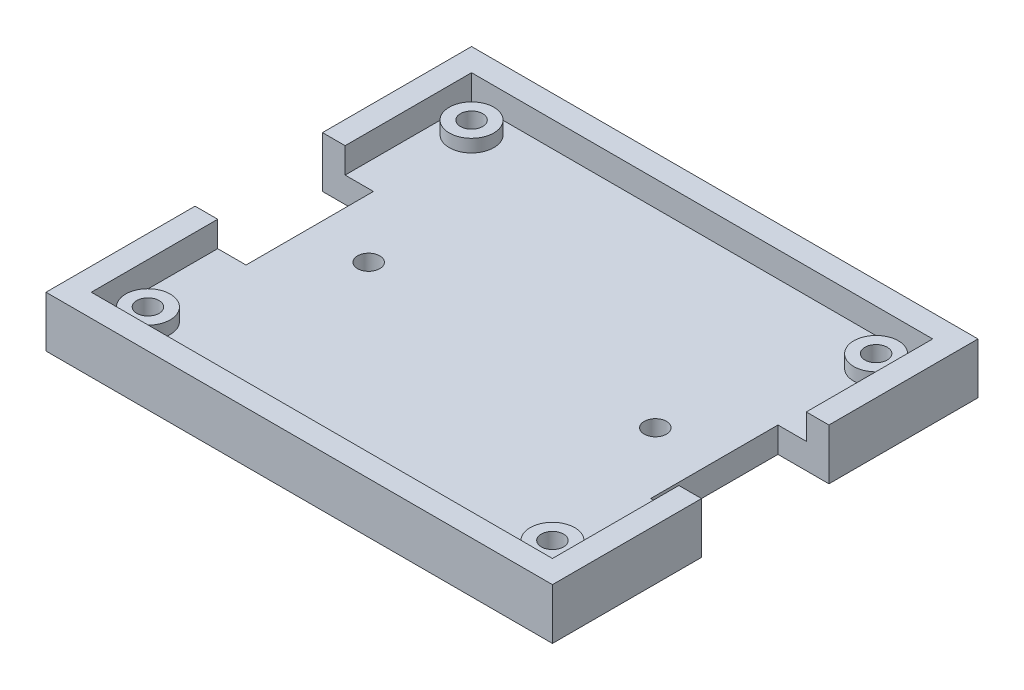
ISO-10303-21;
HEADER;
FILE_DESCRIPTION(('STEP AP214'),'2;1');
FILE_NAME('part.step','',(''),(''),'','','');
FILE_SCHEMA(('AUTOMOTIVE_DESIGN { 1 0 10303 214 1 1 1 1 }'));
ENDSEC;
DATA;
#1=APPLICATION_CONTEXT('core data for automotive mechanical design processes');
#2=APPLICATION_PROTOCOL_DEFINITION('international standard','automotive_design',2000,#1);
#3=PRODUCT_CONTEXT('',#1,'mechanical');
#4=PRODUCT('Part','Part','',(#3));
#5=PRODUCT_RELATED_PRODUCT_CATEGORY('part','',(#4));
#6=PRODUCT_DEFINITION_FORMATION('','',#4);
#7=PRODUCT_DEFINITION_CONTEXT('part definition',#1,'design');
#8=PRODUCT_DEFINITION('design','',#6,#7);
#9=PRODUCT_DEFINITION_SHAPE('','',#8);
#10=(LENGTH_UNIT() NAMED_UNIT(*) SI_UNIT(.MILLI.,.METRE.));
#11=(NAMED_UNIT(*) PLANE_ANGLE_UNIT() SI_UNIT($,.RADIAN.));
#12=(NAMED_UNIT(*) SI_UNIT($,.STERADIAN.) SOLID_ANGLE_UNIT());
#13=UNCERTAINTY_MEASURE_WITH_UNIT(LENGTH_MEASURE(1.E-05),#10,'distance_accuracy_value','');
#14=(GEOMETRIC_REPRESENTATION_CONTEXT(3) GLOBAL_UNCERTAINTY_ASSIGNED_CONTEXT((#13)) GLOBAL_UNIT_ASSIGNED_CONTEXT((#10,
#11,#12)) REPRESENTATION_CONTEXT('',''));
#15=CARTESIAN_POINT('',(0.,0.,0.));
#16=DIRECTION('',(0.,0.,1.));
#17=DIRECTION('',(1.,0.,0.));
#18=AXIS2_PLACEMENT_3D('',#15,#16,#17);
#19=CARTESIAN_POINT('',(0.,4.,10.));
#20=DIRECTION('',(0.,0.,-1.));
#21=DIRECTION('',(-1.,0.,0.));
#22=AXIS2_PLACEMENT_3D('',#19,#20,#21);
#23=PLANE('',#22);
#24=DIRECTION('',(1.,0.,0.));
#25=VECTOR('',#24,1.);
#26=CARTESIAN_POINT('',(0.,0.,10.));
#27=LINE('',#26,#25);
#28=CARTESIAN_POINT('',(31.75,0.,10.));
#29=VERTEX_POINT('',#28);
#30=CARTESIAN_POINT('',(39.75,0.,10.));
#31=VERTEX_POINT('',#30);
#32=EDGE_CURVE('E334',#29,#31,#27,.T.);
#33=ORIENTED_EDGE('',*,*,#32,.F.);
#34=DIRECTION('',(0.,-1.,0.));
#35=VECTOR('',#34,1.);
#36=CARTESIAN_POINT('',(31.75,4.,10.));
#37=LINE('',#36,#35);
#38=CARTESIAN_POINT('',(31.75,4.,10.));
#39=VERTEX_POINT('',#38);
#40=EDGE_CURVE('E11',#39,#29,#37,.T.);
#41=ORIENTED_EDGE('',*,*,#40,.F.);
#42=DIRECTION('',(1.,0.,0.));
#43=VECTOR('',#42,1.);
#44=CARTESIAN_POINT('',(0.,4.,10.));
#45=LINE('',#44,#43);
#46=CARTESIAN_POINT('',(36.195,4.,10.));
#47=VERTEX_POINT('',#46);
#48=EDGE_CURVE('E348',#39,#47,#45,.T.);
#49=ORIENTED_EDGE('',*,*,#48,.T.);
#50=DIRECTION('',(0.,-1.,0.));
#51=VECTOR('',#50,1.);
#52=CARTESIAN_POINT('',(36.195,8.,10.));
#53=LINE('',#52,#51);
#54=CARTESIAN_POINT('',(36.195,8.,10.));
#55=VERTEX_POINT('',#54);
#56=EDGE_CURVE('E304',#55,#47,#53,.T.);
#57=ORIENTED_EDGE('',*,*,#56,.F.);
#58=DIRECTION('',(1.,0.,0.));
#59=VECTOR('',#58,1.);
#60=CARTESIAN_POINT('',(0.,8.,10.));
#61=LINE('',#60,#59);
#62=CARTESIAN_POINT('',(39.75,8.,10.));
#63=VERTEX_POINT('',#62);
#64=EDGE_CURVE('E285',#55,#63,#61,.T.);
#65=ORIENTED_EDGE('',*,*,#64,.T.);
#66=DIRECTION('',(0.,-1.,0.));
#67=VECTOR('',#66,1.);
#68=CARTESIAN_POINT('',(39.75,8.,10.));
#69=LINE('',#68,#67);
#70=EDGE_CURVE('E307',#63,#31,#69,.T.);
#71=ORIENTED_EDGE('',*,*,#70,.T.);
#72=EDGE_LOOP('',(#33,#41,#49,#57,#65,#71));
#73=FACE_BOUND('',#72,.T.);
#74=ADVANCED_FACE('F41',(#73),#23,.T.);
#75=CARTESIAN_POINT('',(31.75,4.,0.));
#76=DIRECTION('',(-1.,0.,0.));
#77=DIRECTION('',(0.,0.,1.));
#78=AXIS2_PLACEMENT_3D('',#75,#76,#77);
#79=PLANE('',#78);
#80=DIRECTION('',(0.,0.,-1.));
#81=VECTOR('',#80,1.);
#82=CARTESIAN_POINT('',(31.75,0.,0.));
#83=LINE('',#82,#81);
#84=CARTESIAN_POINT('',(31.75,0.,-9.99999999999999));
#85=VERTEX_POINT('',#84);
#86=EDGE_CURVE('E396',#29,#85,#83,.T.);
#87=ORIENTED_EDGE('',*,*,#86,.T.);
#88=DIRECTION('',(0.,-1.,0.));
#89=VECTOR('',#88,1.);
#90=CARTESIAN_POINT('',(31.75,4.,-9.99999999999999));
#91=LINE('',#90,#89);
#92=CARTESIAN_POINT('',(31.75,4.,-9.99999999999999));
#93=VERTEX_POINT('',#92);
#94=EDGE_CURVE('E51',#93,#85,#91,.T.);
#95=ORIENTED_EDGE('',*,*,#94,.F.);
#96=DIRECTION('',(0.,0.,-1.));
#97=VECTOR('',#96,1.);
#98=CARTESIAN_POINT('',(31.75,4.,0.));
#99=LINE('',#98,#97);
#100=EDGE_CURVE('E351',#39,#93,#99,.T.);
#101=ORIENTED_EDGE('',*,*,#100,.F.);
#102=ORIENTED_EDGE('',*,*,#40,.T.);
#103=EDGE_LOOP('',(#87,#95,#101,#102));
#104=FACE_BOUND('',#103,.T.);
#105=ADVANCED_FACE('F43',(#104),#79,.F.);
#106=CARTESIAN_POINT('',(0.,4.,-9.99999999999999));
#107=DIRECTION('',(0.,0.,-1.));
#108=DIRECTION('',(-1.,0.,0.));
#109=AXIS2_PLACEMENT_3D('',#106,#107,#108);
#110=PLANE('',#109);
#111=DIRECTION('',(1.,0.,0.));
#112=VECTOR('',#111,1.);
#113=CARTESIAN_POINT('',(0.,0.,-9.99999999999999));
#114=LINE('',#113,#112);
#115=CARTESIAN_POINT('',(39.75,0.,-9.99999999999999));
#116=VERTEX_POINT('',#115);
#117=EDGE_CURVE('E401',#85,#116,#114,.T.);
#118=ORIENTED_EDGE('',*,*,#117,.T.);
#119=DIRECTION('',(0.,-1.,0.));
#120=VECTOR('',#119,1.);
#121=CARTESIAN_POINT('',(39.75,8.,-9.99999999999999));
#122=LINE('',#121,#120);
#123=CARTESIAN_POINT('',(39.75,8.,-9.99999999999999));
#124=VERTEX_POINT('',#123);
#125=EDGE_CURVE('E196',#124,#116,#122,.T.);
#126=ORIENTED_EDGE('',*,*,#125,.F.);
#127=DIRECTION('',(1.,0.,0.));
#128=VECTOR('',#127,1.);
#129=CARTESIAN_POINT('',(0.,8.,-9.99999999999999));
#130=LINE('',#129,#128);
#131=CARTESIAN_POINT('',(36.195,8.,-9.99999999999999));
#132=VERTEX_POINT('',#131);
#133=EDGE_CURVE('E199',#132,#124,#130,.T.);
#134=ORIENTED_EDGE('',*,*,#133,.F.);
#135=DIRECTION('',(0.,-1.,0.));
#136=VECTOR('',#135,1.);
#137=CARTESIAN_POINT('',(36.195,8.,-9.99999999999999));
#138=LINE('',#137,#136);
#139=CARTESIAN_POINT('',(36.195,4.,-9.99999999999999));
#140=VERTEX_POINT('',#139);
#141=EDGE_CURVE('E184',#132,#140,#138,.T.);
#142=ORIENTED_EDGE('',*,*,#141,.T.);
#143=DIRECTION('',(1.,0.,0.));
#144=VECTOR('',#143,1.);
#145=CARTESIAN_POINT('',(0.,4.,-9.99999999999999));
#146=LINE('',#145,#144);
#147=EDGE_CURVE('E356',#93,#140,#146,.T.);
#148=ORIENTED_EDGE('',*,*,#147,.F.);
#149=ORIENTED_EDGE('',*,*,#94,.T.);
#150=EDGE_LOOP('',(#118,#126,#134,#142,#148,#149));
#151=FACE_BOUND('',#150,.T.);
#152=ADVANCED_FACE('F200',(#151),#110,.F.);
#153=CARTESIAN_POINT('',(-39.75,0.,-9.99999999999999));
#154=VERTEX_POINT('',#153);
#155=CARTESIAN_POINT('',(-31.75,0.,-9.99999999999999));
#156=VERTEX_POINT('',#155);
#157=EDGE_CURVE('E404',#154,#156,#114,.T.);
#158=ORIENTED_EDGE('',*,*,#157,.T.);
#159=DIRECTION('',(0.,-1.,0.));
#160=VECTOR('',#159,1.);
#161=CARTESIAN_POINT('',(-31.75,4.,-9.99999999999999));
#162=LINE('',#161,#160);
#163=CARTESIAN_POINT('',(-31.75,4.,-9.99999999999999));
#164=VERTEX_POINT('',#163);
#165=EDGE_CURVE('E74',#164,#156,#162,.T.);
#166=ORIENTED_EDGE('',*,*,#165,.F.);
#167=CARTESIAN_POINT('',(-36.195,4.,-9.99999999999999));
#168=VERTEX_POINT('',#167);
#169=EDGE_CURVE('E359',#168,#164,#146,.T.);
#170=ORIENTED_EDGE('',*,*,#169,.F.);
#171=DIRECTION('',(0.,-1.,0.));
#172=VECTOR('',#171,1.);
#173=CARTESIAN_POINT('',(-36.195,8.,-9.99999999999999));
#174=LINE('',#173,#172);
#175=CARTESIAN_POINT('',(-36.195,8.,-9.99999999999999));
#176=VERTEX_POINT('',#175);
#177=EDGE_CURVE('E253',#176,#168,#174,.T.);
#178=ORIENTED_EDGE('',*,*,#177,.F.);
#179=CARTESIAN_POINT('',(-39.75,8.,-9.99999999999999));
#180=VERTEX_POINT('',#179);
#181=EDGE_CURVE('E207',#180,#176,#130,.T.);
#182=ORIENTED_EDGE('',*,*,#181,.F.);
#183=DIRECTION('',(0.,-1.,0.));
#184=VECTOR('',#183,1.);
#185=CARTESIAN_POINT('',(-39.75,8.,-9.99999999999999));
#186=LINE('',#185,#184);
#187=EDGE_CURVE('E256',#180,#154,#186,.T.);
#188=ORIENTED_EDGE('',*,*,#187,.T.);
#189=EDGE_LOOP('',(#158,#166,#170,#178,#182,#188));
#190=FACE_BOUND('',#189,.T.);
#191=ADVANCED_FACE('F474',(#190),#110,.F.);
#192=CARTESIAN_POINT('',(-31.75,4.,0.));
#193=DIRECTION('',(-1.,0.,0.));
#194=DIRECTION('',(0.,0.,1.));
#195=AXIS2_PLACEMENT_3D('',#192,#193,#194);
#196=PLANE('',#195);
#197=DIRECTION('',(0.,0.,-1.));
#198=VECTOR('',#197,1.);
#199=CARTESIAN_POINT('',(-31.75,0.,0.));
#200=LINE('',#199,#198);
#201=CARTESIAN_POINT('',(-31.75,0.,10.));
#202=VERTEX_POINT('',#201);
#203=EDGE_CURVE('E405',#202,#156,#200,.T.);
#204=ORIENTED_EDGE('',*,*,#203,.F.);
#205=DIRECTION('',(0.,-1.,0.));
#206=VECTOR('',#205,1.);
#207=CARTESIAN_POINT('',(-31.75,4.,10.));
#208=LINE('',#207,#206);
#209=CARTESIAN_POINT('',(-31.75,4.,10.));
#210=VERTEX_POINT('',#209);
#211=EDGE_CURVE('E59',#210,#202,#208,.T.);
#212=ORIENTED_EDGE('',*,*,#211,.F.);
#213=DIRECTION('',(0.,0.,-1.));
#214=VECTOR('',#213,1.);
#215=CARTESIAN_POINT('',(-31.75,4.,0.));
#216=LINE('',#215,#214);
#217=EDGE_CURVE('E368',#210,#164,#216,.T.);
#218=ORIENTED_EDGE('',*,*,#217,.T.);
#219=ORIENTED_EDGE('',*,*,#165,.T.);
#220=EDGE_LOOP('',(#204,#212,#218,#219));
#221=FACE_BOUND('',#220,.T.);
#222=ADVANCED_FACE('F501',(#221),#196,.T.);
#223=CARTESIAN_POINT('',(-39.75,0.,10.));
#224=VERTEX_POINT('',#223);
#225=EDGE_CURVE('E397',#224,#202,#27,.T.);
#226=ORIENTED_EDGE('',*,*,#225,.F.);
#227=DIRECTION('',(0.,-1.,0.));
#228=VECTOR('',#227,1.);
#229=CARTESIAN_POINT('',(-39.75,8.,10.));
#230=LINE('',#229,#228);
#231=CARTESIAN_POINT('',(-39.75,8.,10.));
#232=VERTEX_POINT('',#231);
#233=EDGE_CURVE('E318',#232,#224,#230,.T.);
#234=ORIENTED_EDGE('',*,*,#233,.F.);
#235=CARTESIAN_POINT('',(-36.195,8.,10.));
#236=VERTEX_POINT('',#235);
#237=EDGE_CURVE('E280',#232,#236,#61,.T.);
#238=ORIENTED_EDGE('',*,*,#237,.T.);
#239=DIRECTION('',(0.,-1.,0.));
#240=VECTOR('',#239,1.);
#241=CARTESIAN_POINT('',(-36.195,8.,10.));
#242=LINE('',#241,#240);
#243=CARTESIAN_POINT('',(-36.195,4.,10.));
#244=VERTEX_POINT('',#243);
#245=EDGE_CURVE('E322',#236,#244,#242,.T.);
#246=ORIENTED_EDGE('',*,*,#245,.T.);
#247=EDGE_CURVE('E352',#244,#210,#45,.T.);
#248=ORIENTED_EDGE('',*,*,#247,.T.);
#249=ORIENTED_EDGE('',*,*,#211,.T.);
#250=EDGE_LOOP('',(#226,#234,#238,#246,#248,#249));
#251=FACE_BOUND('',#250,.T.);
#252=ADVANCED_FACE('F445',(#251),#23,.T.);
#253=CARTESIAN_POINT('',(22.5,4.,0.));
#254=DIRECTION('',(0.,-1.,0.));
#255=DIRECTION('',(0.,0.,-1.));
#256=AXIS2_PLACEMENT_3D('',#253,#254,#255);
#257=CYLINDRICAL_SURFACE('',#256,1.75);
#258=CARTESIAN_POINT('',(22.5,4.,0.));
#259=DIRECTION('',(0.,1.,0.));
#260=DIRECTION('',(0.,0.,1.));
#261=AXIS2_PLACEMENT_3D('',#258,#259,#260);
#262=CIRCLE('',#261,1.75);
#263=CARTESIAN_POINT('',(22.5,4.,1.75));
#264=VERTEX_POINT('',#263);
#265=EDGE_CURVE('E386',#264,#264,#262,.T.);
#266=ORIENTED_EDGE('',*,*,#265,.T.);
#267=EDGE_LOOP('',(#266));
#268=FACE_BOUND('',#267,.T.);
#269=CARTESIAN_POINT('',(22.5,0.,0.));
#270=DIRECTION('',(0.,1.,0.));
#271=DIRECTION('',(0.,0.,1.));
#272=AXIS2_PLACEMENT_3D('',#269,#270,#271);
#273=CIRCLE('',#272,1.75);
#274=CARTESIAN_POINT('',(22.5,0.,1.75));
#275=VERTEX_POINT('',#274);
#276=EDGE_CURVE('E409',#275,#275,#273,.T.);
#277=ORIENTED_EDGE('',*,*,#276,.F.);
#278=EDGE_LOOP('',(#277));
#279=FACE_BOUND('',#278,.T.);
#280=ADVANCED_FACE('F500',(#268,#279),#257,.F.);
#281=CARTESIAN_POINT('',(-22.5,4.,0.));
#282=DIRECTION('',(0.,-1.,0.));
#283=DIRECTION('',(0.,0.,-1.));
#284=AXIS2_PLACEMENT_3D('',#281,#282,#283);
#285=CYLINDRICAL_SURFACE('',#284,1.75);
#286=CARTESIAN_POINT('',(-22.5,4.,0.));
#287=DIRECTION('',(0.,1.,0.));
#288=DIRECTION('',(0.,0.,1.));
#289=AXIS2_PLACEMENT_3D('',#286,#287,#288);
#290=CIRCLE('',#289,1.75);
#291=CARTESIAN_POINT('',(-22.5,4.,1.75));
#292=VERTEX_POINT('',#291);
#293=EDGE_CURVE('E390',#292,#292,#290,.T.);
#294=ORIENTED_EDGE('',*,*,#293,.T.);
#295=EDGE_LOOP('',(#294));
#296=FACE_BOUND('',#295,.T.);
#297=CARTESIAN_POINT('',(-22.5,0.,0.));
#298=DIRECTION('',(0.,1.,0.));
#299=DIRECTION('',(0.,0.,1.));
#300=AXIS2_PLACEMENT_3D('',#297,#298,#299);
#301=CIRCLE('',#300,1.75);
#302=CARTESIAN_POINT('',(-22.5,0.,1.75));
#303=VERTEX_POINT('',#302);
#304=EDGE_CURVE('E340',#303,#303,#301,.T.);
#305=ORIENTED_EDGE('',*,*,#304,.F.);
#306=EDGE_LOOP('',(#305));
#307=FACE_BOUND('',#306,.T.);
#308=ADVANCED_FACE('F506',(#296,#307),#285,.F.);
#309=CARTESIAN_POINT('',(0.,4.,0.));
#310=DIRECTION('',(0.,1.,0.));
#311=DIRECTION('',(0.,0.,1.));
#312=AXIS2_PLACEMENT_3D('',#309,#310,#311);
#313=PLANE('',#312);
#314=CARTESIAN_POINT('',(31.75,4.,-25.4));
#315=DIRECTION('',(0.,1.,0.));
#316=DIRECTION('',(0.,0.,1.));
#317=AXIS2_PLACEMENT_3D('',#314,#315,#316);
#318=CIRCLE('',#317,3.5);
#319=CARTESIAN_POINT('',(31.75,4.,-21.9));
#320=VERTEX_POINT('',#319);
#321=EDGE_CURVE('E335',#320,#320,#318,.T.);
#322=ORIENTED_EDGE('',*,*,#321,.F.);
#323=EDGE_LOOP('',(#322));
#324=FACE_BOUND('',#323,.T.);
#325=CARTESIAN_POINT('',(-31.75,4.,-25.4));
#326=DIRECTION('',(0.,1.,0.));
#327=DIRECTION('',(0.,0.,1.));
#328=AXIS2_PLACEMENT_3D('',#325,#326,#327);
#329=CIRCLE('',#328,3.5);
#330=CARTESIAN_POINT('',(-31.75,4.,-21.9));
#331=VERTEX_POINT('',#330);
#332=EDGE_CURVE('E339',#331,#331,#329,.T.);
#333=ORIENTED_EDGE('',*,*,#332,.F.);
#334=EDGE_LOOP('',(#333));
#335=FACE_BOUND('',#334,.T.);
#336=CARTESIAN_POINT('',(31.75,4.,25.4));
#337=DIRECTION('',(0.,1.,0.));
#338=DIRECTION('',(0.,0.,1.));
#339=AXIS2_PLACEMENT_3D('',#336,#337,#338);
#340=CIRCLE('',#339,3.5);
#341=CARTESIAN_POINT('',(31.75,4.,28.9));
#342=VERTEX_POINT('',#341);
#343=EDGE_CURVE('E344',#342,#342,#340,.T.);
#344=ORIENTED_EDGE('',*,*,#343,.F.);
#345=EDGE_LOOP('',(#344));
#346=FACE_BOUND('',#345,.T.);
#347=ORIENTED_EDGE('',*,*,#48,.F.);
#348=ORIENTED_EDGE('',*,*,#100,.T.);
#349=ORIENTED_EDGE('',*,*,#147,.T.);
#350=DIRECTION('',(0.,0.,-1.));
#351=VECTOR('',#350,1.);
#352=CARTESIAN_POINT('',(36.195,4.,0.));
#353=LINE('',#352,#351);
#354=CARTESIAN_POINT('',(36.195,4.,-29.845));
#355=VERTEX_POINT('',#354);
#356=EDGE_CURVE('E191',#140,#355,#353,.T.);
#357=ORIENTED_EDGE('',*,*,#356,.T.);
#358=DIRECTION('',(1.,0.,0.));
#359=VECTOR('',#358,1.);
#360=CARTESIAN_POINT('',(0.,4.,-29.845));
#361=LINE('',#360,#359);
#362=CARTESIAN_POINT('',(-36.195,4.,-29.845));
#363=VERTEX_POINT('',#362);
#364=EDGE_CURVE('E362',#363,#355,#361,.T.);
#365=ORIENTED_EDGE('',*,*,#364,.F.);
#366=DIRECTION('',(0.,0.,-1.));
#367=VECTOR('',#366,1.);
#368=CARTESIAN_POINT('',(-36.195,4.,0.));
#369=LINE('',#368,#367);
#370=EDGE_CURVE('E365',#168,#363,#369,.T.);
#371=ORIENTED_EDGE('',*,*,#370,.F.);
#372=ORIENTED_EDGE('',*,*,#169,.T.);
#373=ORIENTED_EDGE('',*,*,#217,.F.);
#374=ORIENTED_EDGE('',*,*,#247,.F.);
#375=DIRECTION('',(0.,0.,-1.));
#376=VECTOR('',#375,1.);
#377=CARTESIAN_POINT('',(-36.195,4.,0.));
#378=LINE('',#377,#376);
#379=CARTESIAN_POINT('',(-36.195,4.,29.845));
#380=VERTEX_POINT('',#379);
#381=EDGE_CURVE('E371',#380,#244,#378,.T.);
#382=ORIENTED_EDGE('',*,*,#381,.F.);
#383=DIRECTION('',(1.,0.,0.));
#384=VECTOR('',#383,1.);
#385=CARTESIAN_POINT('',(0.,4.,29.845));
#386=LINE('',#385,#384);
#387=CARTESIAN_POINT('',(36.195,4.,29.845));
#388=VERTEX_POINT('',#387);
#389=EDGE_CURVE('E374',#380,#388,#386,.T.);
#390=ORIENTED_EDGE('',*,*,#389,.T.);
#391=DIRECTION('',(0.,0.,-1.));
#392=VECTOR('',#391,1.);
#393=CARTESIAN_POINT('',(36.195,4.,0.));
#394=LINE('',#393,#392);
#395=EDGE_CURVE('E378',#388,#47,#394,.T.);
#396=ORIENTED_EDGE('',*,*,#395,.T.);
#397=EDGE_LOOP('',(#347,#348,#349,#357,#365,#371,#372,#373,#374,#382,#390,#396));
#398=FACE_BOUND('',#397,.T.);
#399=CARTESIAN_POINT('',(-31.75,4.,25.4));
#400=DIRECTION('',(0.,1.,0.));
#401=DIRECTION('',(0.,0.,1.));
#402=AXIS2_PLACEMENT_3D('',#399,#400,#401);
#403=CIRCLE('',#402,3.5);
#404=CARTESIAN_POINT('',(-31.75,4.,28.9));
#405=VERTEX_POINT('',#404);
#406=EDGE_CURVE('E382',#405,#405,#403,.T.);
#407=ORIENTED_EDGE('',*,*,#406,.F.);
#408=EDGE_LOOP('',(#407));
#409=FACE_BOUND('',#408,.T.);
#410=ORIENTED_EDGE('',*,*,#265,.F.);
#411=EDGE_LOOP('',(#410));
#412=FACE_BOUND('',#411,.T.);
#413=ORIENTED_EDGE('',*,*,#293,.F.);
#414=EDGE_LOOP('',(#413));
#415=FACE_BOUND('',#414,.T.);
#416=ADVANCED_FACE('F458',(#324,#335,#346,#398,#409,#412,#415),#313,.T.);
#417=CARTESIAN_POINT('',(0.,0.,0.));
#418=DIRECTION('',(0.,1.,0.));
#419=DIRECTION('',(0.,0.,1.));
#420=AXIS2_PLACEMENT_3D('',#417,#418,#419);
#421=PLANE('',#420);
#422=ORIENTED_EDGE('',*,*,#32,.T.);
#423=DIRECTION('',(0.,0.,-1.));
#424=VECTOR('',#423,1.);
#425=CARTESIAN_POINT('',(39.75,0.,0.));
#426=LINE('',#425,#424);
#427=CARTESIAN_POINT('',(39.75,0.,33.4));
#428=VERTEX_POINT('',#427);
#429=EDGE_CURVE('E273',#428,#31,#426,.T.);
#430=ORIENTED_EDGE('',*,*,#429,.F.);
#431=DIRECTION('',(1.,0.,0.));
#432=VECTOR('',#431,1.);
#433=CARTESIAN_POINT('',(0.,0.,33.4));
#434=LINE('',#433,#432);
#435=CARTESIAN_POINT('',(-39.75,0.,33.4));
#436=VERTEX_POINT('',#435);
#437=EDGE_CURVE('E298',#436,#428,#434,.T.);
#438=ORIENTED_EDGE('',*,*,#437,.F.);
#439=DIRECTION('',(0.,0.,-1.));
#440=VECTOR('',#439,1.);
#441=CARTESIAN_POINT('',(-39.75,0.,0.));
#442=LINE('',#441,#440);
#443=EDGE_CURVE('E195',#436,#224,#442,.T.);
#444=ORIENTED_EDGE('',*,*,#443,.T.);
#445=ORIENTED_EDGE('',*,*,#225,.T.);
#446=ORIENTED_EDGE('',*,*,#203,.T.);
#447=ORIENTED_EDGE('',*,*,#157,.F.);
#448=DIRECTION('',(0.,0.,-1.));
#449=VECTOR('',#448,1.);
#450=CARTESIAN_POINT('',(-39.75,0.,0.));
#451=LINE('',#450,#449);
#452=CARTESIAN_POINT('',(-39.75,0.,-33.4));
#453=VERTEX_POINT('',#452);
#454=EDGE_CURVE('E213',#154,#453,#451,.T.);
#455=ORIENTED_EDGE('',*,*,#454,.T.);
#456=DIRECTION('',(1.,0.,0.));
#457=VECTOR('',#456,1.);
#458=CARTESIAN_POINT('',(0.,0.,-33.4));
#459=LINE('',#458,#457);
#460=CARTESIAN_POINT('',(39.75,0.,-33.4));
#461=VERTEX_POINT('',#460);
#462=EDGE_CURVE('E217',#453,#461,#459,.T.);
#463=ORIENTED_EDGE('',*,*,#462,.T.);
#464=DIRECTION('',(0.,0.,-1.));
#465=VECTOR('',#464,1.);
#466=CARTESIAN_POINT('',(39.75,0.,0.));
#467=LINE('',#466,#465);
#468=EDGE_CURVE('E239',#116,#461,#467,.T.);
#469=ORIENTED_EDGE('',*,*,#468,.F.);
#470=ORIENTED_EDGE('',*,*,#117,.F.);
#471=ORIENTED_EDGE('',*,*,#86,.F.);
#472=EDGE_LOOP('',(#422,#430,#438,#444,#445,#446,#447,#455,#463,#469,#470,#471));
#473=FACE_BOUND('',#472,.T.);
#474=ORIENTED_EDGE('',*,*,#276,.T.);
#475=EDGE_LOOP('',(#474));
#476=FACE_BOUND('',#475,.T.);
#477=ORIENTED_EDGE('',*,*,#304,.T.);
#478=EDGE_LOOP('',(#477));
#479=FACE_BOUND('',#478,.T.);
#480=CARTESIAN_POINT('',(31.75,0.,25.4));
#481=DIRECTION('',(0.,1.,0.));
#482=DIRECTION('',(0.,0.,1.));
#483=AXIS2_PLACEMENT_3D('',#480,#481,#482);
#484=CIRCLE('',#483,1.75);
#485=CARTESIAN_POINT('',(31.75,0.,27.15));
#486=VERTEX_POINT('',#485);
#487=EDGE_CURVE('E220',#486,#486,#484,.T.);
#488=ORIENTED_EDGE('',*,*,#487,.T.);
#489=EDGE_LOOP('',(#488));
#490=FACE_BOUND('',#489,.T.);
#491=CARTESIAN_POINT('',(-31.75,0.,25.4));
#492=DIRECTION('',(0.,1.,0.));
#493=DIRECTION('',(0.,0.,1.));
#494=AXIS2_PLACEMENT_3D('',#491,#492,#493);
#495=CIRCLE('',#494,1.75);
#496=CARTESIAN_POINT('',(-31.75,0.,27.15));
#497=VERTEX_POINT('',#496);
#498=EDGE_CURVE('E750',#497,#497,#495,.T.);
#499=ORIENTED_EDGE('',*,*,#498,.T.);
#500=EDGE_LOOP('',(#499));
#501=FACE_BOUND('',#500,.T.);
#502=CARTESIAN_POINT('',(-31.75,0.,-25.4));
#503=DIRECTION('',(0.,1.,0.));
#504=DIRECTION('',(0.,0.,1.));
#505=AXIS2_PLACEMENT_3D('',#502,#503,#504);
#506=CIRCLE('',#505,1.75);
#507=CARTESIAN_POINT('',(-31.75,0.,-23.65));
#508=VERTEX_POINT('',#507);
#509=EDGE_CURVE('E731',#508,#508,#506,.T.);
#510=ORIENTED_EDGE('',*,*,#509,.T.);
#511=EDGE_LOOP('',(#510));
#512=FACE_BOUND('',#511,.T.);
#513=CARTESIAN_POINT('',(31.75,0.,-25.4));
#514=DIRECTION('',(0.,1.,0.));
#515=DIRECTION('',(0.,0.,1.));
#516=AXIS2_PLACEMENT_3D('',#513,#514,#515);
#517=CIRCLE('',#516,1.75);
#518=CARTESIAN_POINT('',(31.75,0.,-23.65));
#519=VERTEX_POINT('',#518);
#520=EDGE_CURVE('E738',#519,#519,#517,.T.);
#521=ORIENTED_EDGE('',*,*,#520,.T.);
#522=EDGE_LOOP('',(#521));
#523=FACE_BOUND('',#522,.T.);
#524=ADVANCED_FACE('F425',(#473,#476,#479,#490,#501,#512,#523),#421,.F.);
#525=CARTESIAN_POINT('',(36.195,8.,0.));
#526=DIRECTION('',(-1.,0.,0.));
#527=DIRECTION('',(0.,0.,1.));
#528=AXIS2_PLACEMENT_3D('',#525,#526,#527);
#529=PLANE('',#528);
#530=ORIENTED_EDGE('',*,*,#56,.T.);
#531=ORIENTED_EDGE('',*,*,#395,.F.);
#532=DIRECTION('',(0.,-1.,0.));
#533=VECTOR('',#532,1.);
#534=CARTESIAN_POINT('',(36.195,8.,29.845));
#535=LINE('',#534,#533);
#536=CARTESIAN_POINT('',(36.195,8.,29.845));
#537=VERTEX_POINT('',#536);
#538=EDGE_CURVE('E330',#537,#388,#535,.T.);
#539=ORIENTED_EDGE('',*,*,#538,.F.);
#540=DIRECTION('',(0.,0.,-1.));
#541=VECTOR('',#540,1.);
#542=CARTESIAN_POINT('',(36.195,8.,0.));
#543=LINE('',#542,#541);
#544=EDGE_CURVE('E268',#537,#55,#543,.T.);
#545=ORIENTED_EDGE('',*,*,#544,.T.);
#546=EDGE_LOOP('',(#530,#531,#539,#545));
#547=FACE_BOUND('',#546,.T.);
#548=ADVANCED_FACE('F482',(#547),#529,.T.);
#549=CARTESIAN_POINT('',(0.,8.,29.845));
#550=DIRECTION('',(0.,0.,-1.));
#551=DIRECTION('',(-1.,0.,0.));
#552=AXIS2_PLACEMENT_3D('',#549,#550,#551);
#553=PLANE('',#552);
#554=ORIENTED_EDGE('',*,*,#538,.T.);
#555=ORIENTED_EDGE('',*,*,#389,.F.);
#556=DIRECTION('',(0.,-1.,0.));
#557=VECTOR('',#556,1.);
#558=CARTESIAN_POINT('',(-36.195,8.,29.845));
#559=LINE('',#558,#557);
#560=CARTESIAN_POINT('',(-36.195,8.,29.845));
#561=VERTEX_POINT('',#560);
#562=EDGE_CURVE('E326',#561,#380,#559,.T.);
#563=ORIENTED_EDGE('',*,*,#562,.F.);
#564=DIRECTION('',(1.,0.,0.));
#565=VECTOR('',#564,1.);
#566=CARTESIAN_POINT('',(0.,8.,29.845));
#567=LINE('',#566,#565);
#568=EDGE_CURVE('E272',#561,#537,#567,.T.);
#569=ORIENTED_EDGE('',*,*,#568,.T.);
#570=EDGE_LOOP('',(#554,#555,#563,#569));
#571=FACE_BOUND('',#570,.T.);
#572=ADVANCED_FACE('F808',(#571),#553,.T.);
#573=CARTESIAN_POINT('',(-36.195,8.,0.));
#574=DIRECTION('',(-1.,0.,0.));
#575=DIRECTION('',(0.,0.,1.));
#576=AXIS2_PLACEMENT_3D('',#573,#574,#575);
#577=PLANE('',#576);
#578=ORIENTED_EDGE('',*,*,#381,.T.);
#579=ORIENTED_EDGE('',*,*,#245,.F.);
#580=DIRECTION('',(0.,0.,-1.));
#581=VECTOR('',#580,1.);
#582=CARTESIAN_POINT('',(-36.195,8.,0.));
#583=LINE('',#582,#581);
#584=EDGE_CURVE('E277',#561,#236,#583,.T.);
#585=ORIENTED_EDGE('',*,*,#584,.F.);
#586=ORIENTED_EDGE('',*,*,#562,.T.);
#587=EDGE_LOOP('',(#578,#579,#585,#586));
#588=FACE_BOUND('',#587,.T.);
#589=ADVANCED_FACE('F453',(#588),#577,.F.);
#590=CARTESIAN_POINT('',(-39.75,8.,0.));
#591=DIRECTION('',(-1.,0.,0.));
#592=DIRECTION('',(0.,0.,1.));
#593=AXIS2_PLACEMENT_3D('',#590,#591,#592);
#594=PLANE('',#593);
#595=ORIENTED_EDGE('',*,*,#443,.F.);
#596=DIRECTION('',(0.,-1.,0.));
#597=VECTOR('',#596,1.);
#598=CARTESIAN_POINT('',(-39.75,8.,33.4));
#599=LINE('',#598,#597);
#600=CARTESIAN_POINT('',(-39.75,8.,33.4));
#601=VERTEX_POINT('',#600);
#602=EDGE_CURVE('E315',#601,#436,#599,.T.);
#603=ORIENTED_EDGE('',*,*,#602,.F.);
#604=DIRECTION('',(0.,0.,-1.));
#605=VECTOR('',#604,1.);
#606=CARTESIAN_POINT('',(-39.75,8.,0.));
#607=LINE('',#606,#605);
#608=EDGE_CURVE('E284',#601,#232,#607,.T.);
#609=ORIENTED_EDGE('',*,*,#608,.T.);
#610=ORIENTED_EDGE('',*,*,#233,.T.);
#611=EDGE_LOOP('',(#595,#603,#609,#610));
#612=FACE_BOUND('',#611,.T.);
#613=ADVANCED_FACE('F441',(#612),#594,.T.);
#614=CARTESIAN_POINT('',(0.,8.,33.4));
#615=DIRECTION('',(0.,0.,-1.));
#616=DIRECTION('',(-1.,0.,0.));
#617=AXIS2_PLACEMENT_3D('',#614,#615,#616);
#618=PLANE('',#617);
#619=ORIENTED_EDGE('',*,*,#437,.T.);
#620=DIRECTION('',(0.,-1.,0.));
#621=VECTOR('',#620,1.);
#622=CARTESIAN_POINT('',(39.75,8.,33.4));
#623=LINE('',#622,#621);
#624=CARTESIAN_POINT('',(39.75,8.,33.4));
#625=VERTEX_POINT('',#624);
#626=EDGE_CURVE('E311',#625,#428,#623,.T.);
#627=ORIENTED_EDGE('',*,*,#626,.F.);
#628=DIRECTION('',(1.,0.,0.));
#629=VECTOR('',#628,1.);
#630=CARTESIAN_POINT('',(0.,8.,33.4));
#631=LINE('',#630,#629);
#632=EDGE_CURVE('E289',#601,#625,#631,.T.);
#633=ORIENTED_EDGE('',*,*,#632,.F.);
#634=ORIENTED_EDGE('',*,*,#602,.T.);
#635=EDGE_LOOP('',(#619,#627,#633,#634));
#636=FACE_BOUND('',#635,.T.);
#637=ADVANCED_FACE('F483',(#636),#618,.F.);
#638=CARTESIAN_POINT('',(39.75,8.,0.));
#639=DIRECTION('',(-1.,0.,0.));
#640=DIRECTION('',(0.,0.,1.));
#641=AXIS2_PLACEMENT_3D('',#638,#639,#640);
#642=PLANE('',#641);
#643=ORIENTED_EDGE('',*,*,#429,.T.);
#644=ORIENTED_EDGE('',*,*,#70,.F.);
#645=DIRECTION('',(0.,0.,-1.));
#646=VECTOR('',#645,1.);
#647=CARTESIAN_POINT('',(39.75,8.,0.));
#648=LINE('',#647,#646);
#649=EDGE_CURVE('E292',#625,#63,#648,.T.);
#650=ORIENTED_EDGE('',*,*,#649,.F.);
#651=ORIENTED_EDGE('',*,*,#626,.T.);
#652=EDGE_LOOP('',(#643,#644,#650,#651));
#653=FACE_BOUND('',#652,.T.);
#654=ADVANCED_FACE('F434',(#653),#642,.F.);
#655=CARTESIAN_POINT('',(0.,8.,0.));
#656=DIRECTION('',(0.,1.,0.));
#657=DIRECTION('',(0.,0.,1.));
#658=AXIS2_PLACEMENT_3D('',#655,#656,#657);
#659=PLANE('',#658);
#660=ORIENTED_EDGE('',*,*,#544,.F.);
#661=ORIENTED_EDGE('',*,*,#568,.F.);
#662=ORIENTED_EDGE('',*,*,#584,.T.);
#663=ORIENTED_EDGE('',*,*,#237,.F.);
#664=ORIENTED_EDGE('',*,*,#608,.F.);
#665=ORIENTED_EDGE('',*,*,#632,.T.);
#666=ORIENTED_EDGE('',*,*,#649,.T.);
#667=ORIENTED_EDGE('',*,*,#64,.F.);
#668=EDGE_LOOP('',(#660,#661,#662,#663,#664,#665,#666,#667));
#669=FACE_BOUND('',#668,.T.);
#670=ADVANCED_FACE('F448',(#669),#659,.T.);
#671=CARTESIAN_POINT('',(36.195,8.,0.));
#672=DIRECTION('',(-1.,0.,0.));
#673=DIRECTION('',(0.,0.,1.));
#674=AXIS2_PLACEMENT_3D('',#671,#672,#673);
#675=PLANE('',#674);
#676=DIRECTION('',(0.,-1.,0.));
#677=VECTOR('',#676,1.);
#678=CARTESIAN_POINT('',(36.195,8.,-29.845));
#679=LINE('',#678,#677);
#680=CARTESIAN_POINT('',(36.195,8.,-29.845));
#681=VERTEX_POINT('',#680);
#682=EDGE_CURVE('E238',#681,#355,#679,.T.);
#683=ORIENTED_EDGE('',*,*,#682,.T.);
#684=ORIENTED_EDGE('',*,*,#356,.F.);
#685=ORIENTED_EDGE('',*,*,#141,.F.);
#686=DIRECTION('',(0.,0.,-1.));
#687=VECTOR('',#686,1.);
#688=CARTESIAN_POINT('',(36.195,8.,0.));
#689=LINE('',#688,#687);
#690=EDGE_CURVE('E189',#132,#681,#689,.T.);
#691=ORIENTED_EDGE('',*,*,#690,.T.);
#692=EDGE_LOOP('',(#683,#684,#685,#691));
#693=FACE_BOUND('',#692,.T.);
#694=ADVANCED_FACE('F187',(#693),#675,.T.);
#695=CARTESIAN_POINT('',(39.75,8.,0.));
#696=DIRECTION('',(-1.,0.,0.));
#697=DIRECTION('',(0.,0.,1.));
#698=AXIS2_PLACEMENT_3D('',#695,#696,#697);
#699=PLANE('',#698);
#700=ORIENTED_EDGE('',*,*,#468,.T.);
#701=DIRECTION('',(0.,-1.,0.));
#702=VECTOR('',#701,1.);
#703=CARTESIAN_POINT('',(39.75,8.,-33.4));
#704=LINE('',#703,#702);
#705=CARTESIAN_POINT('',(39.75,8.,-33.4));
#706=VERTEX_POINT('',#705);
#707=EDGE_CURVE('E263',#706,#461,#704,.T.);
#708=ORIENTED_EDGE('',*,*,#707,.F.);
#709=DIRECTION('',(0.,0.,-1.));
#710=VECTOR('',#709,1.);
#711=CARTESIAN_POINT('',(39.75,8.,0.));
#712=LINE('',#711,#710);
#713=EDGE_CURVE('E205',#124,#706,#712,.T.);
#714=ORIENTED_EDGE('',*,*,#713,.F.);
#715=ORIENTED_EDGE('',*,*,#125,.T.);
#716=EDGE_LOOP('',(#700,#708,#714,#715));
#717=FACE_BOUND('',#716,.T.);
#718=ADVANCED_FACE('F519',(#717),#699,.F.);
#719=CARTESIAN_POINT('',(0.,8.,-33.4));
#720=DIRECTION('',(0.,0.,-1.));
#721=DIRECTION('',(-1.,0.,0.));
#722=AXIS2_PLACEMENT_3D('',#719,#720,#721);
#723=PLANE('',#722);
#724=ORIENTED_EDGE('',*,*,#462,.F.);
#725=DIRECTION('',(0.,-1.,0.));
#726=VECTOR('',#725,1.);
#727=CARTESIAN_POINT('',(-39.75,8.,-33.4));
#728=LINE('',#727,#726);
#729=CARTESIAN_POINT('',(-39.75,8.,-33.4));
#730=VERTEX_POINT('',#729);
#731=EDGE_CURVE('E260',#730,#453,#728,.T.);
#732=ORIENTED_EDGE('',*,*,#731,.F.);
#733=DIRECTION('',(1.,0.,0.));
#734=VECTOR('',#733,1.);
#735=CARTESIAN_POINT('',(0.,8.,-33.4));
#736=LINE('',#735,#734);
#737=EDGE_CURVE('E225',#730,#706,#736,.T.);
#738=ORIENTED_EDGE('',*,*,#737,.T.);
#739=ORIENTED_EDGE('',*,*,#707,.T.);
#740=EDGE_LOOP('',(#724,#732,#738,#739));
#741=FACE_BOUND('',#740,.T.);
#742=ADVANCED_FACE('F516',(#741),#723,.T.);
#743=CARTESIAN_POINT('',(-39.75,8.,0.));
#744=DIRECTION('',(-1.,0.,0.));
#745=DIRECTION('',(0.,0.,1.));
#746=AXIS2_PLACEMENT_3D('',#743,#744,#745);
#747=PLANE('',#746);
#748=ORIENTED_EDGE('',*,*,#454,.F.);
#749=ORIENTED_EDGE('',*,*,#187,.F.);
#750=DIRECTION('',(0.,0.,-1.));
#751=VECTOR('',#750,1.);
#752=CARTESIAN_POINT('',(-39.75,8.,0.));
#753=LINE('',#752,#751);
#754=EDGE_CURVE('E229',#180,#730,#753,.T.);
#755=ORIENTED_EDGE('',*,*,#754,.T.);
#756=ORIENTED_EDGE('',*,*,#731,.T.);
#757=EDGE_LOOP('',(#748,#749,#755,#756));
#758=FACE_BOUND('',#757,.T.);
#759=ADVANCED_FACE('F513',(#758),#747,.T.);
#760=CARTESIAN_POINT('',(-36.195,8.,0.));
#761=DIRECTION('',(-1.,0.,0.));
#762=DIRECTION('',(0.,0.,1.));
#763=AXIS2_PLACEMENT_3D('',#760,#761,#762);
#764=PLANE('',#763);
#765=ORIENTED_EDGE('',*,*,#370,.T.);
#766=DIRECTION('',(0.,-1.,0.));
#767=VECTOR('',#766,1.);
#768=CARTESIAN_POINT('',(-36.195,8.,-29.845));
#769=LINE('',#768,#767);
#770=CARTESIAN_POINT('',(-36.195,8.,-29.845));
#771=VERTEX_POINT('',#770);
#772=EDGE_CURVE('E249',#771,#363,#769,.T.);
#773=ORIENTED_EDGE('',*,*,#772,.F.);
#774=DIRECTION('',(0.,0.,-1.));
#775=VECTOR('',#774,1.);
#776=CARTESIAN_POINT('',(-36.195,8.,0.));
#777=LINE('',#776,#775);
#778=EDGE_CURVE('E233',#176,#771,#777,.T.);
#779=ORIENTED_EDGE('',*,*,#778,.F.);
#780=ORIENTED_EDGE('',*,*,#177,.T.);
#781=EDGE_LOOP('',(#765,#773,#779,#780));
#782=FACE_BOUND('',#781,.T.);
#783=ADVANCED_FACE('F477',(#782),#764,.F.);
#784=CARTESIAN_POINT('',(0.,8.,-29.845));
#785=DIRECTION('',(0.,0.,-1.));
#786=DIRECTION('',(-1.,0.,0.));
#787=AXIS2_PLACEMENT_3D('',#784,#785,#786);
#788=PLANE('',#787);
#789=ORIENTED_EDGE('',*,*,#364,.T.);
#790=ORIENTED_EDGE('',*,*,#682,.F.);
#791=DIRECTION('',(1.,0.,0.));
#792=VECTOR('',#791,1.);
#793=CARTESIAN_POINT('',(0.,8.,-29.845));
#794=LINE('',#793,#792);
#795=EDGE_CURVE('E210',#771,#681,#794,.T.);
#796=ORIENTED_EDGE('',*,*,#795,.F.);
#797=ORIENTED_EDGE('',*,*,#772,.T.);
#798=EDGE_LOOP('',(#789,#790,#796,#797));
#799=FACE_BOUND('',#798,.T.);
#800=ADVANCED_FACE('F480',(#799),#788,.F.);
#801=CARTESIAN_POINT('',(0.,8.,0.));
#802=DIRECTION('',(0.,1.,0.));
#803=DIRECTION('',(0.,0.,1.));
#804=AXIS2_PLACEMENT_3D('',#801,#802,#803);
#805=PLANE('',#804);
#806=ORIENTED_EDGE('',*,*,#690,.F.);
#807=ORIENTED_EDGE('',*,*,#133,.T.);
#808=ORIENTED_EDGE('',*,*,#713,.T.);
#809=ORIENTED_EDGE('',*,*,#737,.F.);
#810=ORIENTED_EDGE('',*,*,#754,.F.);
#811=ORIENTED_EDGE('',*,*,#181,.T.);
#812=ORIENTED_EDGE('',*,*,#778,.T.);
#813=ORIENTED_EDGE('',*,*,#795,.T.);
#814=EDGE_LOOP('',(#806,#807,#808,#809,#810,#811,#812,#813));
#815=FACE_BOUND('',#814,.T.);
#816=ADVANCED_FACE('F208',(#815),#805,.T.);
#817=CARTESIAN_POINT('',(31.75,6.,25.4));
#818=DIRECTION('',(0.,-1.,0.));
#819=DIRECTION('',(0.,0.,-1.));
#820=AXIS2_PLACEMENT_3D('',#817,#818,#819);
#821=CYLINDRICAL_SURFACE('',#820,1.75);
#822=CARTESIAN_POINT('',(31.75,6.,25.4));
#823=DIRECTION('',(0.,1.,0.));
#824=DIRECTION('',(0.,0.,1.));
#825=AXIS2_PLACEMENT_3D('',#822,#823,#824);
#826=CIRCLE('',#825,1.75);
#827=CARTESIAN_POINT('',(31.75,6.,27.15));
#828=VERTEX_POINT('',#827);
#829=EDGE_CURVE('E763',#828,#828,#826,.T.);
#830=ORIENTED_EDGE('',*,*,#829,.T.);
#831=EDGE_LOOP('',(#830));
#832=FACE_BOUND('',#831,.T.);
#833=ORIENTED_EDGE('',*,*,#487,.F.);
#834=EDGE_LOOP('',(#833));
#835=FACE_BOUND('',#834,.T.);
#836=ADVANCED_FACE('F581',(#832,#835),#821,.F.);
#837=CARTESIAN_POINT('',(31.75,6.,25.4));
#838=DIRECTION('',(0.,-1.,0.));
#839=DIRECTION('',(0.,0.,-1.));
#840=AXIS2_PLACEMENT_3D('',#837,#838,#839);
#841=CYLINDRICAL_SURFACE('',#840,3.5);
#842=ORIENTED_EDGE('',*,*,#343,.T.);
#843=EDGE_LOOP('',(#842));
#844=FACE_BOUND('',#843,.T.);
#845=CARTESIAN_POINT('',(31.75,6.,25.4));
#846=DIRECTION('',(0.,1.,0.));
#847=DIRECTION('',(0.,0.,1.));
#848=AXIS2_PLACEMENT_3D('',#845,#846,#847);
#849=CIRCLE('',#848,3.5);
#850=CARTESIAN_POINT('',(31.75,6.,28.9));
#851=VERTEX_POINT('',#850);
#852=EDGE_CURVE('E243',#851,#851,#849,.T.);
#853=ORIENTED_EDGE('',*,*,#852,.F.);
#854=EDGE_LOOP('',(#853));
#855=FACE_BOUND('',#854,.T.);
#856=ADVANCED_FACE('F602',(#844,#855),#841,.T.);
#857=CARTESIAN_POINT('',(0.,6.,0.));
#858=DIRECTION('',(0.,1.,0.));
#859=DIRECTION('',(0.,0.,1.));
#860=AXIS2_PLACEMENT_3D('',#857,#858,#859);
#861=PLANE('',#860);
#862=ORIENTED_EDGE('',*,*,#829,.F.);
#863=EDGE_LOOP('',(#862));
#864=FACE_BOUND('',#863,.T.);
#865=ORIENTED_EDGE('',*,*,#852,.T.);
#866=EDGE_LOOP('',(#865));
#867=FACE_BOUND('',#866,.T.);
#868=ADVANCED_FACE('F612',(#864,#867),#861,.T.);
#869=CARTESIAN_POINT('',(-31.75,6.,25.4));
#870=DIRECTION('',(0.,-1.,0.));
#871=DIRECTION('',(0.,0.,-1.));
#872=AXIS2_PLACEMENT_3D('',#869,#870,#871);
#873=CYLINDRICAL_SURFACE('',#872,3.5);
#874=ORIENTED_EDGE('',*,*,#406,.T.);
#875=EDGE_LOOP('',(#874));
#876=FACE_BOUND('',#875,.T.);
#877=CARTESIAN_POINT('',(-31.75,6.,25.4));
#878=DIRECTION('',(0.,1.,0.));
#879=DIRECTION('',(0.,0.,1.));
#880=AXIS2_PLACEMENT_3D('',#877,#878,#879);
#881=CIRCLE('',#880,3.5);
#882=CARTESIAN_POINT('',(-31.75,6.,28.9));
#883=VERTEX_POINT('',#882);
#884=EDGE_CURVE('E752',#883,#883,#881,.T.);
#885=ORIENTED_EDGE('',*,*,#884,.F.);
#886=EDGE_LOOP('',(#885));
#887=FACE_BOUND('',#886,.T.);
#888=ADVANCED_FACE('F623',(#876,#887),#873,.T.);
#889=CARTESIAN_POINT('',(-31.75,6.,25.4));
#890=DIRECTION('',(0.,-1.,0.));
#891=DIRECTION('',(0.,0.,-1.));
#892=AXIS2_PLACEMENT_3D('',#889,#890,#891);
#893=CYLINDRICAL_SURFACE('',#892,1.75);
#894=CARTESIAN_POINT('',(-31.75,6.,25.4));
#895=DIRECTION('',(0.,1.,0.));
#896=DIRECTION('',(0.,0.,1.));
#897=AXIS2_PLACEMENT_3D('',#894,#895,#896);
#898=CIRCLE('',#897,1.75);
#899=CARTESIAN_POINT('',(-31.75,6.,27.15));
#900=VERTEX_POINT('',#899);
#901=EDGE_CURVE('E756',#900,#900,#898,.T.);
#902=ORIENTED_EDGE('',*,*,#901,.T.);
#903=EDGE_LOOP('',(#902));
#904=FACE_BOUND('',#903,.T.);
#905=ORIENTED_EDGE('',*,*,#498,.F.);
#906=EDGE_LOOP('',(#905));
#907=FACE_BOUND('',#906,.T.);
#908=ADVANCED_FACE('F633',(#904,#907),#893,.F.);
#909=CARTESIAN_POINT('',(0.,6.,0.));
#910=DIRECTION('',(0.,1.,0.));
#911=DIRECTION('',(0.,0.,1.));
#912=AXIS2_PLACEMENT_3D('',#909,#910,#911);
#913=PLANE('',#912);
#914=ORIENTED_EDGE('',*,*,#884,.T.);
#915=EDGE_LOOP('',(#914));
#916=FACE_BOUND('',#915,.T.);
#917=ORIENTED_EDGE('',*,*,#901,.F.);
#918=EDGE_LOOP('',(#917));
#919=FACE_BOUND('',#918,.T.);
#920=ADVANCED_FACE('F643',(#916,#919),#913,.T.);
#921=CARTESIAN_POINT('',(-31.75,6.,-25.4));
#922=DIRECTION('',(0.,-1.,0.));
#923=DIRECTION('',(0.,0.,-1.));
#924=AXIS2_PLACEMENT_3D('',#921,#922,#923);
#925=CYLINDRICAL_SURFACE('',#924,3.5);
#926=ORIENTED_EDGE('',*,*,#332,.T.);
#927=EDGE_LOOP('',(#926));
#928=FACE_BOUND('',#927,.T.);
#929=CARTESIAN_POINT('',(-31.75,6.,-25.4));
#930=DIRECTION('',(0.,1.,0.));
#931=DIRECTION('',(0.,0.,1.));
#932=AXIS2_PLACEMENT_3D('',#929,#930,#931);
#933=CIRCLE('',#932,3.5);
#934=CARTESIAN_POINT('',(-31.75,6.,-21.9));
#935=VERTEX_POINT('',#934);
#936=EDGE_CURVE('E736',#935,#935,#933,.T.);
#937=ORIENTED_EDGE('',*,*,#936,.F.);
#938=EDGE_LOOP('',(#937));
#939=FACE_BOUND('',#938,.T.);
#940=ADVANCED_FACE('F654',(#928,#939),#925,.T.);
#941=CARTESIAN_POINT('',(-31.75,6.,-25.4));
#942=DIRECTION('',(0.,-1.,0.));
#943=DIRECTION('',(0.,0.,-1.));
#944=AXIS2_PLACEMENT_3D('',#941,#942,#943);
#945=CYLINDRICAL_SURFACE('',#944,1.75);
#946=CARTESIAN_POINT('',(-31.75,6.,-25.4));
#947=DIRECTION('',(0.,1.,0.));
#948=DIRECTION('',(0.,0.,1.));
#949=AXIS2_PLACEMENT_3D('',#946,#947,#948);
#950=CIRCLE('',#949,1.75);
#951=CARTESIAN_POINT('',(-31.75,6.,-23.65));
#952=VERTEX_POINT('',#951);
#953=EDGE_CURVE('E747',#952,#952,#950,.T.);
#954=ORIENTED_EDGE('',*,*,#953,.T.);
#955=EDGE_LOOP('',(#954));
#956=FACE_BOUND('',#955,.T.);
#957=ORIENTED_EDGE('',*,*,#509,.F.);
#958=EDGE_LOOP('',(#957));
#959=FACE_BOUND('',#958,.T.);
#960=ADVANCED_FACE('F664',(#956,#959),#945,.F.);
#961=CARTESIAN_POINT('',(0.,6.,0.));
#962=DIRECTION('',(0.,1.,0.));
#963=DIRECTION('',(0.,0.,1.));
#964=AXIS2_PLACEMENT_3D('',#961,#962,#963);
#965=PLANE('',#964);
#966=ORIENTED_EDGE('',*,*,#936,.T.);
#967=EDGE_LOOP('',(#966));
#968=FACE_BOUND('',#967,.T.);
#969=ORIENTED_EDGE('',*,*,#953,.F.);
#970=EDGE_LOOP('',(#969));
#971=FACE_BOUND('',#970,.T.);
#972=ADVANCED_FACE('F674',(#968,#971),#965,.T.);
#973=CARTESIAN_POINT('',(31.75,6.,-25.4));
#974=DIRECTION('',(0.,-1.,0.));
#975=DIRECTION('',(0.,0.,-1.));
#976=AXIS2_PLACEMENT_3D('',#973,#974,#975);
#977=CYLINDRICAL_SURFACE('',#976,1.75);
#978=CARTESIAN_POINT('',(31.75,6.,-25.4));
#979=DIRECTION('',(0.,1.,0.));
#980=DIRECTION('',(0.,0.,1.));
#981=AXIS2_PLACEMENT_3D('',#978,#979,#980);
#982=CIRCLE('',#981,1.75);
#983=CARTESIAN_POINT('',(31.75,6.,-23.65));
#984=VERTEX_POINT('',#983);
#985=EDGE_CURVE('E725',#984,#984,#982,.T.);
#986=ORIENTED_EDGE('',*,*,#985,.T.);
#987=EDGE_LOOP('',(#986));
#988=FACE_BOUND('',#987,.T.);
#989=ORIENTED_EDGE('',*,*,#520,.F.);
#990=EDGE_LOOP('',(#989));
#991=FACE_BOUND('',#990,.T.);
#992=ADVANCED_FACE('F685',(#988,#991),#977,.F.);
#993=CARTESIAN_POINT('',(31.75,6.,-25.4));
#994=DIRECTION('',(0.,-1.,0.));
#995=DIRECTION('',(0.,0.,-1.));
#996=AXIS2_PLACEMENT_3D('',#993,#994,#995);
#997=CYLINDRICAL_SURFACE('',#996,3.5);
#998=ORIENTED_EDGE('',*,*,#321,.T.);
#999=EDGE_LOOP('',(#998));
#1000=FACE_BOUND('',#999,.T.);
#1001=CARTESIAN_POINT('',(31.75,6.,-25.4));
#1002=DIRECTION('',(0.,1.,0.));
#1003=DIRECTION('',(0.,0.,1.));
#1004=AXIS2_PLACEMENT_3D('',#1001,#1002,#1003);
#1005=CIRCLE('',#1004,3.5);
#1006=CARTESIAN_POINT('',(31.75,6.,-21.9));
#1007=VERTEX_POINT('',#1006);
#1008=EDGE_CURVE('E728',#1007,#1007,#1005,.T.);
#1009=ORIENTED_EDGE('',*,*,#1008,.F.);
#1010=EDGE_LOOP('',(#1009));
#1011=FACE_BOUND('',#1010,.T.);
#1012=ADVANCED_FACE('F695',(#1000,#1011),#997,.T.);
#1013=CARTESIAN_POINT('',(0.,6.,0.));
#1014=DIRECTION('',(0.,1.,0.));
#1015=DIRECTION('',(0.,0.,1.));
#1016=AXIS2_PLACEMENT_3D('',#1013,#1014,#1015);
#1017=PLANE('',#1016);
#1018=ORIENTED_EDGE('',*,*,#985,.F.);
#1019=EDGE_LOOP('',(#1018));
#1020=FACE_BOUND('',#1019,.T.);
#1021=ORIENTED_EDGE('',*,*,#1008,.T.);
#1022=EDGE_LOOP('',(#1021));
#1023=FACE_BOUND('',#1022,.T.);
#1024=ADVANCED_FACE('F705',(#1020,#1023),#1017,.T.);
#1025=CLOSED_SHELL('',(#74,#105,#152,#191,#222,#252,#280,#308,#416,#524,#548,#572,#589,#613,
#637,#654,#670,#694,#718,#742,#759,#783,#800,#816,#836,#856,#868,#888,#908,#920,#940,#960,#972,
#992,#1012,#1024));
#1026=MANIFOLD_SOLID_BREP('B2',#1025);
#1027=ADVANCED_BREP_SHAPE_REPRESENTATION('',(#18,#1026),#14);
#1028=SHAPE_DEFINITION_REPRESENTATION(#9,#1027);
ENDSEC;
END-ISO-10303-21;
